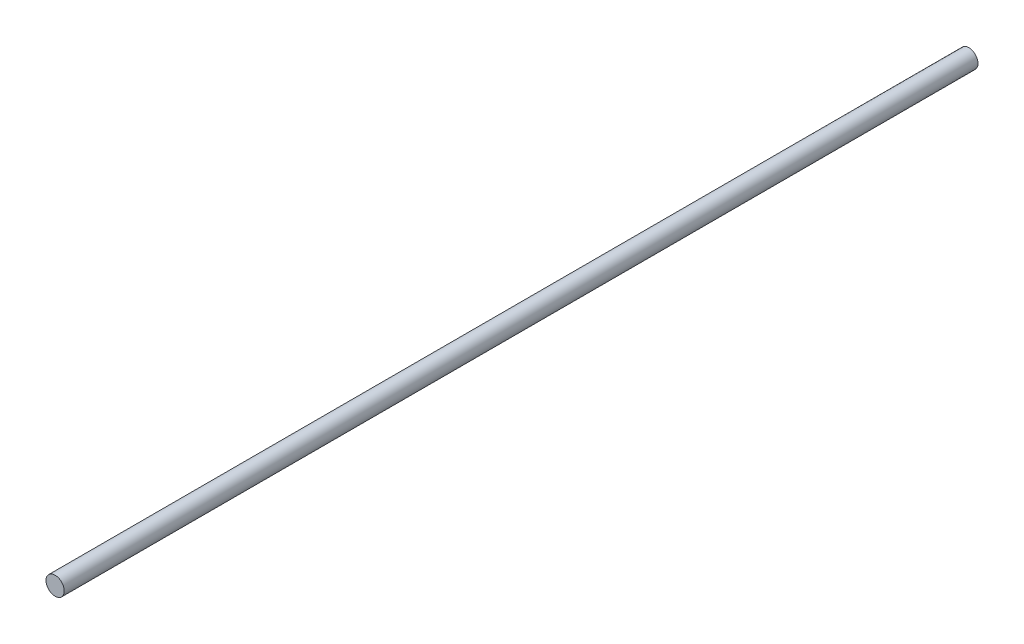
ISO-10303-21;
HEADER;
FILE_DESCRIPTION(('STEP AP214'),'2;1');
FILE_NAME('part.step','',(''),(''),'','','');
FILE_SCHEMA(('AUTOMOTIVE_DESIGN { 1 0 10303 214 1 1 1 1 }'));
ENDSEC;
DATA;
#1=APPLICATION_CONTEXT('core data for automotive mechanical design processes');
#2=APPLICATION_PROTOCOL_DEFINITION('international standard','automotive_design',2000,#1);
#3=PRODUCT_CONTEXT('',#1,'mechanical');
#4=PRODUCT('Part','Part','',(#3));
#5=PRODUCT_RELATED_PRODUCT_CATEGORY('part','',(#4));
#6=PRODUCT_DEFINITION_FORMATION('','',#4);
#7=PRODUCT_DEFINITION_CONTEXT('part definition',#1,'design');
#8=PRODUCT_DEFINITION('design','',#6,#7);
#9=PRODUCT_DEFINITION_SHAPE('','',#8);
#10=(LENGTH_UNIT() NAMED_UNIT(*) SI_UNIT(.MILLI.,.METRE.));
#11=(NAMED_UNIT(*) PLANE_ANGLE_UNIT() SI_UNIT($,.RADIAN.));
#12=(NAMED_UNIT(*) SI_UNIT($,.STERADIAN.) SOLID_ANGLE_UNIT());
#13=UNCERTAINTY_MEASURE_WITH_UNIT(LENGTH_MEASURE(1.E-05),#10,'distance_accuracy_value','');
#14=(GEOMETRIC_REPRESENTATION_CONTEXT(3) GLOBAL_UNCERTAINTY_ASSIGNED_CONTEXT((#13)) GLOBAL_UNIT_ASSIGNED_CONTEXT((#10,
#11,#12)) REPRESENTATION_CONTEXT('',''));
#15=CARTESIAN_POINT('',(0.,0.,0.));
#16=DIRECTION('',(0.,0.,1.));
#17=DIRECTION('',(1.,0.,0.));
#18=AXIS2_PLACEMENT_3D('',#15,#16,#17);
#19=CARTESIAN_POINT('',(0.,0.,400.));
#20=DIRECTION('',(0.,0.,-1.));
#21=DIRECTION('',(-1.,0.,0.));
#22=AXIS2_PLACEMENT_3D('',#19,#20,#21);
#23=CYLINDRICAL_SURFACE('',#22,4.);
#24=CARTESIAN_POINT('',(0.,0.,400.));
#25=DIRECTION('',(0.,0.,1.));
#26=DIRECTION('',(1.,0.,0.));
#27=AXIS2_PLACEMENT_3D('',#24,#25,#26);
#28=CIRCLE('',#27,4.);
#29=CARTESIAN_POINT('',(4.,0.,400.));
#30=VERTEX_POINT('',#29);
#31=EDGE_CURVE('E10',#30,#30,#28,.T.);
#32=ORIENTED_EDGE('',*,*,#31,.F.);
#33=EDGE_LOOP('',(#32));
#34=FACE_BOUND('',#33,.T.);
#35=CARTESIAN_POINT('',(0.,0.,0.));
#36=DIRECTION('',(0.,0.,1.));
#37=DIRECTION('',(1.,0.,0.));
#38=AXIS2_PLACEMENT_3D('',#35,#36,#37);
#39=CIRCLE('',#38,4.);
#40=CARTESIAN_POINT('',(4.,0.,0.));
#41=VERTEX_POINT('',#40);
#42=EDGE_CURVE('E40',#41,#41,#39,.T.);
#43=ORIENTED_EDGE('',*,*,#42,.T.);
#44=EDGE_LOOP('',(#43));
#45=FACE_BOUND('',#44,.T.);
#46=ADVANCED_FACE('F37',(#34,#45),#23,.T.);
#47=CARTESIAN_POINT('',(0.,0.,400.));
#48=DIRECTION('',(0.,0.,1.));
#49=DIRECTION('',(1.,0.,0.));
#50=AXIS2_PLACEMENT_3D('',#47,#48,#49);
#51=PLANE('',#50);
#52=ORIENTED_EDGE('',*,*,#31,.T.);
#53=EDGE_LOOP('',(#52));
#54=FACE_BOUND('',#53,.T.);
#55=ADVANCED_FACE('F54',(#54),#51,.T.);
#56=CARTESIAN_POINT('',(0.,0.,0.));
#57=DIRECTION('',(0.,0.,1.));
#58=DIRECTION('',(1.,0.,0.));
#59=AXIS2_PLACEMENT_3D('',#56,#57,#58);
#60=PLANE('',#59);
#61=ORIENTED_EDGE('',*,*,#42,.F.);
#62=EDGE_LOOP('',(#61));
#63=FACE_BOUND('',#62,.T.);
#64=ADVANCED_FACE('F52',(#63),#60,.F.);
#65=CLOSED_SHELL('',(#46,#55,#64));
#66=MANIFOLD_SOLID_BREP('B2',#65);
#67=ADVANCED_BREP_SHAPE_REPRESENTATION('',(#18,#66),#14);
#68=SHAPE_DEFINITION_REPRESENTATION(#9,#67);
ENDSEC;
END-ISO-10303-21;
